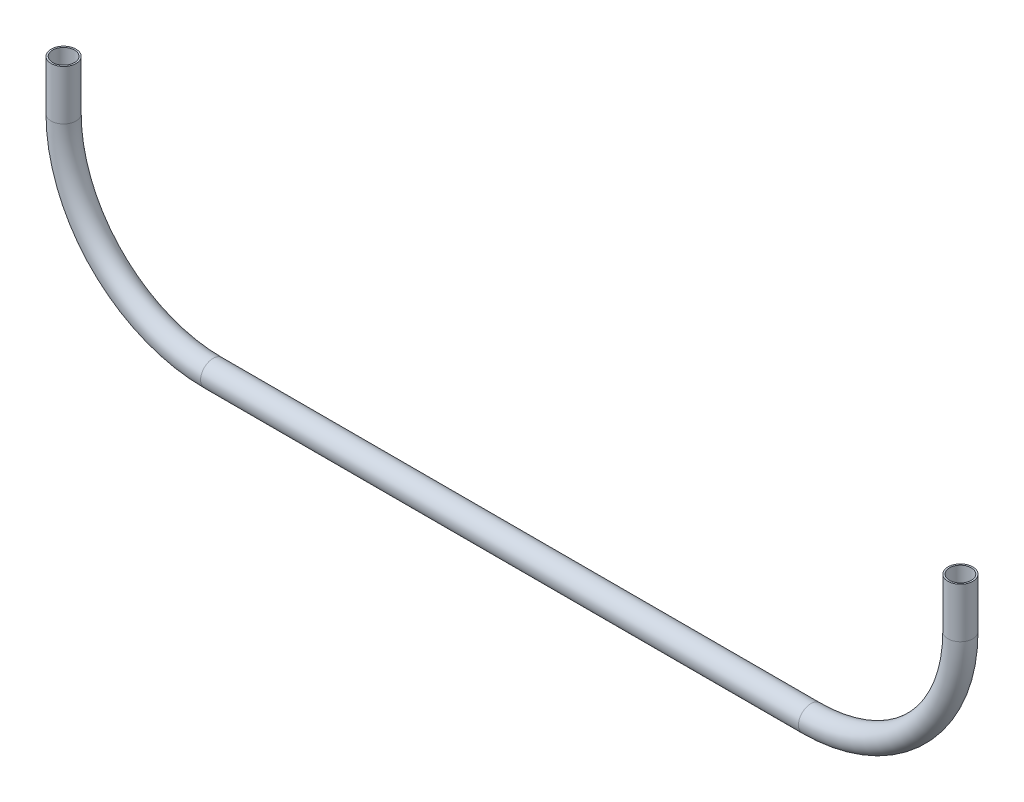
ISO-10303-21;
HEADER;
FILE_DESCRIPTION(('STEP AP214'),'2;1');
FILE_NAME('part.step','',(''),(''),'','','');
FILE_SCHEMA(('AUTOMOTIVE_DESIGN { 1 0 10303 214 1 1 1 1 }'));
ENDSEC;
DATA;
#1=APPLICATION_CONTEXT('core data for automotive mechanical design processes');
#2=APPLICATION_PROTOCOL_DEFINITION('international standard','automotive_design',2000,#1);
#3=PRODUCT_CONTEXT('',#1,'mechanical');
#4=PRODUCT('Part','Part','',(#3));
#5=PRODUCT_RELATED_PRODUCT_CATEGORY('part','',(#4));
#6=PRODUCT_DEFINITION_FORMATION('','',#4);
#7=PRODUCT_DEFINITION_CONTEXT('part definition',#1,'design');
#8=PRODUCT_DEFINITION('design','',#6,#7);
#9=PRODUCT_DEFINITION_SHAPE('','',#8);
#10=(LENGTH_UNIT() NAMED_UNIT(*) SI_UNIT(.MILLI.,.METRE.));
#11=(NAMED_UNIT(*) PLANE_ANGLE_UNIT() SI_UNIT($,.RADIAN.));
#12=(NAMED_UNIT(*) SI_UNIT($,.STERADIAN.) SOLID_ANGLE_UNIT());
#13=UNCERTAINTY_MEASURE_WITH_UNIT(LENGTH_MEASURE(1.E-05),#10,'distance_accuracy_value','');
#14=(GEOMETRIC_REPRESENTATION_CONTEXT(3) GLOBAL_UNCERTAINTY_ASSIGNED_CONTEXT((#13)) GLOBAL_UNIT_ASSIGNED_CONTEXT((#10,
#11,#12)) REPRESENTATION_CONTEXT('',''));
#15=CARTESIAN_POINT('',(0.,0.,0.));
#16=DIRECTION('',(0.,0.,1.));
#17=DIRECTION('',(1.,0.,0.));
#18=AXIS2_PLACEMENT_3D('',#15,#16,#17);
#19=CARTESIAN_POINT('',(228.6,76.2000000000006,0.));
#20=DIRECTION('',(0.,1.,0.));
#21=DIRECTION('',(0.,0.,1.));
#22=AXIS2_PLACEMENT_3D('',#19,#20,#21);
#23=CYLINDRICAL_SURFACE('',#22,6.35);
#24=CARTESIAN_POINT('',(228.6,76.2000000000006,0.));
#25=DIRECTION('',(0.,-1.,0.));
#26=DIRECTION('',(0.,0.,1.));
#27=AXIS2_PLACEMENT_3D('',#24,#25,#26);
#28=CIRCLE('',#27,6.35);
#29=CARTESIAN_POINT('',(234.95,76.2000000000007,0.));
#30=VERTEX_POINT('',#29);
#31=EDGE_CURVE('E43',#30,#30,#28,.T.);
#32=ORIENTED_EDGE('',*,*,#31,.F.);
#33=EDGE_LOOP('',(#32));
#34=FACE_BOUND('',#33,.T.);
#35=CARTESIAN_POINT('',(228.6,101.6,0.));
#36=DIRECTION('',(0.,-1.,0.));
#37=DIRECTION('',(0.,0.,1.));
#38=AXIS2_PLACEMENT_3D('',#35,#36,#37);
#39=CIRCLE('',#38,6.35);
#40=CARTESIAN_POINT('',(228.6,101.6,6.35));
#41=VERTEX_POINT('',#40);
#42=EDGE_CURVE('E10',#41,#41,#39,.T.);
#43=ORIENTED_EDGE('',*,*,#42,.T.);
#44=EDGE_LOOP('',(#43));
#45=FACE_BOUND('',#44,.T.);
#46=ADVANCED_FACE('F33',(#34,#45),#23,.T.);
#47=CARTESIAN_POINT('',(228.6,76.2000000000006,0.));
#48=DIRECTION('',(0.,1.,0.));
#49=DIRECTION('',(0.,0.,1.));
#50=AXIS2_PLACEMENT_3D('',#47,#48,#49);
#51=CYLINDRICAL_SURFACE('',#50,5.55625);
#52=CARTESIAN_POINT('',(228.6,76.2000000000006,0.));
#53=DIRECTION('',(0.,-1.,0.));
#54=DIRECTION('',(0.,0.,1.));
#55=AXIS2_PLACEMENT_3D('',#52,#53,#54);
#56=CIRCLE('',#55,5.55625);
#57=CARTESIAN_POINT('',(234.15625,76.2000000000007,0.));
#58=VERTEX_POINT('',#57);
#59=EDGE_CURVE('E47',#58,#58,#56,.T.);
#60=ORIENTED_EDGE('',*,*,#59,.T.);
#61=EDGE_LOOP('',(#60));
#62=FACE_BOUND('',#61,.T.);
#63=CARTESIAN_POINT('',(228.6,101.6,0.));
#64=DIRECTION('',(0.,-1.,0.));
#65=DIRECTION('',(0.,0.,1.));
#66=AXIS2_PLACEMENT_3D('',#63,#64,#65);
#67=CIRCLE('',#66,5.55625);
#68=CARTESIAN_POINT('',(228.6,101.6,5.55625));
#69=VERTEX_POINT('',#68);
#70=EDGE_CURVE('E39',#69,#69,#67,.T.);
#71=ORIENTED_EDGE('',*,*,#70,.F.);
#72=EDGE_LOOP('',(#71));
#73=FACE_BOUND('',#72,.T.);
#74=ADVANCED_FACE('F102',(#62,#73),#51,.F.);
#75=CARTESIAN_POINT('',(152.4,76.2000000000001,0.));
#76=DIRECTION('',(0.,0.,1.));
#77=DIRECTION('',(1.,0.,0.));
#78=AXIS2_PLACEMENT_3D('',#75,#76,#77);
#79=TOROIDAL_SURFACE('',#78,76.2,6.35);
#80=CARTESIAN_POINT('',(152.399999999999,0.,0.));
#81=DIRECTION('',(-1.,0.,0.));
#82=DIRECTION('',(0.,0.,1.));
#83=AXIS2_PLACEMENT_3D('',#80,#81,#82);
#84=CIRCLE('',#83,6.35);
#85=CARTESIAN_POINT('',(152.399999999999,-6.3499999999999,0.));
#86=VERTEX_POINT('',#85);
#87=EDGE_CURVE('E52',#86,#86,#84,.T.);
#88=CARTESIAN_POINT('',(152.4,76.2000000000001,0.));
#89=DIRECTION('',(0.,0.,1.));
#90=DIRECTION('',(1.,0.,0.));
#91=AXIS2_PLACEMENT_3D('',#88,#89,#90);
#92=CIRCLE('',#91,82.55);
#93=EDGE_CURVE('',#86,#30,#92,.T.);
#94=ORIENTED_EDGE('',*,*,#87,.F.);
#95=ORIENTED_EDGE('',*,*,#31,.T.);
#96=ORIENTED_EDGE('',*,*,#93,.T.);
#97=ORIENTED_EDGE('',*,*,#93,.F.);
#98=EDGE_LOOP('',(#94,#96,#95,#97));
#99=FACE_BOUND('',#98,.T.);
#100=ADVANCED_FACE('F107',(#99),#79,.T.);
#101=CARTESIAN_POINT('',(152.4,76.2000000000001,0.));
#102=DIRECTION('',(0.,0.,1.));
#103=DIRECTION('',(1.,0.,0.));
#104=AXIS2_PLACEMENT_3D('',#101,#102,#103);
#105=TOROIDAL_SURFACE('',#104,76.2,5.55625);
#106=CARTESIAN_POINT('',(152.399999999999,0.,0.));
#107=DIRECTION('',(-1.,0.,0.));
#108=DIRECTION('',(0.,0.,1.));
#109=AXIS2_PLACEMENT_3D('',#106,#107,#108);
#110=CIRCLE('',#109,5.55625);
#111=CARTESIAN_POINT('',(152.399999999999,-5.5562499999999,0.));
#112=VERTEX_POINT('',#111);
#113=EDGE_CURVE('E55',#112,#112,#110,.T.);
#114=CARTESIAN_POINT('',(152.4,76.2000000000001,0.));
#115=DIRECTION('',(0.,0.,1.));
#116=DIRECTION('',(1.,0.,0.));
#117=AXIS2_PLACEMENT_3D('',#114,#115,#116);
#118=CIRCLE('',#117,81.75625);
#119=EDGE_CURVE('',#112,#58,#118,.T.);
#120=ORIENTED_EDGE('',*,*,#113,.T.);
#121=ORIENTED_EDGE('',*,*,#59,.F.);
#122=ORIENTED_EDGE('',*,*,#119,.T.);
#123=ORIENTED_EDGE('',*,*,#119,.F.);
#124=EDGE_LOOP('',(#120,#122,#121,#123));
#125=FACE_BOUND('',#124,.T.);
#126=ADVANCED_FACE('F112',(#125),#105,.F.);
#127=CARTESIAN_POINT('',(-152.399999999999,0.,0.));
#128=DIRECTION('',(1.,0.,0.));
#129=DIRECTION('',(0.,1.,0.));
#130=AXIS2_PLACEMENT_3D('',#127,#128,#129);
#131=CYLINDRICAL_SURFACE('',#130,6.35);
#132=CARTESIAN_POINT('',(-152.399999999999,0.,0.));
#133=DIRECTION('',(-1.,0.,0.));
#134=DIRECTION('',(0.,0.,1.));
#135=AXIS2_PLACEMENT_3D('',#132,#133,#134);
#136=CIRCLE('',#135,6.35);
#137=CARTESIAN_POINT('',(-152.399999999999,-6.34999999999995,0.));
#138=VERTEX_POINT('',#137);
#139=EDGE_CURVE('E58',#138,#138,#136,.T.);
#140=ORIENTED_EDGE('',*,*,#139,.F.);
#141=EDGE_LOOP('',(#140));
#142=FACE_BOUND('',#141,.T.);
#143=ORIENTED_EDGE('',*,*,#87,.T.);
#144=EDGE_LOOP('',(#143));
#145=FACE_BOUND('',#144,.T.);
#146=ADVANCED_FACE('F118',(#142,#145),#131,.T.);
#147=CARTESIAN_POINT('',(-152.399999999999,0.,0.));
#148=DIRECTION('',(1.,0.,0.));
#149=DIRECTION('',(0.,1.,0.));
#150=AXIS2_PLACEMENT_3D('',#147,#148,#149);
#151=CYLINDRICAL_SURFACE('',#150,5.55625);
#152=CARTESIAN_POINT('',(-152.399999999999,0.,0.));
#153=DIRECTION('',(-1.,0.,0.));
#154=DIRECTION('',(0.,0.,1.));
#155=AXIS2_PLACEMENT_3D('',#152,#153,#154);
#156=CIRCLE('',#155,5.55625);
#157=CARTESIAN_POINT('',(-152.399999999999,-5.55624999999996,0.));
#158=VERTEX_POINT('',#157);
#159=EDGE_CURVE('E61',#158,#158,#156,.T.);
#160=ORIENTED_EDGE('',*,*,#159,.T.);
#161=EDGE_LOOP('',(#160));
#162=FACE_BOUND('',#161,.T.);
#163=ORIENTED_EDGE('',*,*,#113,.F.);
#164=EDGE_LOOP('',(#163));
#165=FACE_BOUND('',#164,.T.);
#166=ADVANCED_FACE('F125',(#162,#165),#151,.F.);
#167=CARTESIAN_POINT('',(-152.4,76.2,0.));
#168=DIRECTION('',(0.,0.,1.));
#169=DIRECTION('',(1.,0.,0.));
#170=AXIS2_PLACEMENT_3D('',#167,#168,#169);
#171=TOROIDAL_SURFACE('',#170,76.2,6.35);
#172=CARTESIAN_POINT('',(-228.6,76.2000000000006,0.));
#173=DIRECTION('',(0.,1.,0.));
#174=DIRECTION('',(0.,0.,1.));
#175=AXIS2_PLACEMENT_3D('',#172,#173,#174);
#176=CIRCLE('',#175,6.35);
#177=CARTESIAN_POINT('',(-234.95,76.2000000000006,0.));
#178=VERTEX_POINT('',#177);
#179=EDGE_CURVE('E64',#178,#178,#176,.T.);
#180=CARTESIAN_POINT('',(-152.4,76.2,0.));
#181=DIRECTION('',(0.,0.,1.));
#182=DIRECTION('',(1.,0.,0.));
#183=AXIS2_PLACEMENT_3D('',#180,#181,#182);
#184=CIRCLE('',#183,82.55);
#185=EDGE_CURVE('',#178,#138,#184,.T.);
#186=ORIENTED_EDGE('',*,*,#179,.F.);
#187=ORIENTED_EDGE('',*,*,#139,.T.);
#188=ORIENTED_EDGE('',*,*,#185,.T.);
#189=ORIENTED_EDGE('',*,*,#185,.F.);
#190=EDGE_LOOP('',(#186,#188,#187,#189));
#191=FACE_BOUND('',#190,.T.);
#192=ADVANCED_FACE('F129',(#191),#171,.T.);
#193=CARTESIAN_POINT('',(-152.4,76.2,0.));
#194=DIRECTION('',(0.,0.,1.));
#195=DIRECTION('',(1.,0.,0.));
#196=AXIS2_PLACEMENT_3D('',#193,#194,#195);
#197=TOROIDAL_SURFACE('',#196,76.2,5.55625);
#198=CARTESIAN_POINT('',(-228.6,76.2000000000006,0.));
#199=DIRECTION('',(0.,1.,0.));
#200=DIRECTION('',(0.,0.,1.));
#201=AXIS2_PLACEMENT_3D('',#198,#199,#200);
#202=CIRCLE('',#201,5.55625);
#203=CARTESIAN_POINT('',(-234.15625,76.2000000000006,0.));
#204=VERTEX_POINT('',#203);
#205=EDGE_CURVE('E68',#204,#204,#202,.T.);
#206=CARTESIAN_POINT('',(-152.4,76.2,0.));
#207=DIRECTION('',(0.,0.,1.));
#208=DIRECTION('',(1.,0.,0.));
#209=AXIS2_PLACEMENT_3D('',#206,#207,#208);
#210=CIRCLE('',#209,81.75625);
#211=EDGE_CURVE('',#204,#158,#210,.T.);
#212=ORIENTED_EDGE('',*,*,#205,.T.);
#213=ORIENTED_EDGE('',*,*,#159,.F.);
#214=ORIENTED_EDGE('',*,*,#211,.T.);
#215=ORIENTED_EDGE('',*,*,#211,.F.);
#216=EDGE_LOOP('',(#212,#214,#213,#215));
#217=FACE_BOUND('',#216,.T.);
#218=ADVANCED_FACE('F77',(#217),#197,.F.);
#219=CARTESIAN_POINT('',(-228.6,76.2000000000006,0.));
#220=DIRECTION('',(0.,1.,0.));
#221=DIRECTION('',(0.,0.,1.));
#222=AXIS2_PLACEMENT_3D('',#219,#220,#221);
#223=CYLINDRICAL_SURFACE('',#222,5.55625);
#224=ORIENTED_EDGE('',*,*,#205,.F.);
#225=EDGE_LOOP('',(#224));
#226=FACE_BOUND('',#225,.T.);
#227=CARTESIAN_POINT('',(-228.6,101.6,0.));
#228=DIRECTION('',(0.,1.,0.));
#229=DIRECTION('',(0.,0.,1.));
#230=AXIS2_PLACEMENT_3D('',#227,#228,#229);
#231=CIRCLE('',#230,5.55625);
#232=CARTESIAN_POINT('',(-228.6,101.6,5.55625));
#233=VERTEX_POINT('',#232);
#234=EDGE_CURVE('E69',#233,#233,#231,.T.);
#235=ORIENTED_EDGE('',*,*,#234,.T.);
#236=EDGE_LOOP('',(#235));
#237=FACE_BOUND('',#236,.T.);
#238=ADVANCED_FACE('F80',(#226,#237),#223,.F.);
#239=CARTESIAN_POINT('',(-228.6,76.2000000000006,0.));
#240=DIRECTION('',(0.,1.,0.));
#241=DIRECTION('',(0.,0.,1.));
#242=AXIS2_PLACEMENT_3D('',#239,#240,#241);
#243=CYLINDRICAL_SURFACE('',#242,6.35);
#244=ORIENTED_EDGE('',*,*,#179,.T.);
#245=EDGE_LOOP('',(#244));
#246=FACE_BOUND('',#245,.T.);
#247=CARTESIAN_POINT('',(-228.6,101.6,0.));
#248=DIRECTION('',(0.,1.,0.));
#249=DIRECTION('',(0.,0.,1.));
#250=AXIS2_PLACEMENT_3D('',#247,#248,#249);
#251=CIRCLE('',#250,6.35);
#252=CARTESIAN_POINT('',(-228.6,101.6,6.35));
#253=VERTEX_POINT('',#252);
#254=EDGE_CURVE('E65',#253,#253,#251,.T.);
#255=ORIENTED_EDGE('',*,*,#254,.F.);
#256=EDGE_LOOP('',(#255));
#257=FACE_BOUND('',#256,.T.);
#258=ADVANCED_FACE('F83',(#246,#257),#243,.T.);
#259=CARTESIAN_POINT('',(228.6,101.6,0.));
#260=DIRECTION('',(0.,-1.,0.));
#261=DIRECTION('',(0.,0.,1.));
#262=AXIS2_PLACEMENT_3D('',#259,#260,#261);
#263=PLANE('',#262);
#264=ORIENTED_EDGE('',*,*,#70,.T.);
#265=EDGE_LOOP('',(#264));
#266=FACE_BOUND('',#265,.T.);
#267=ORIENTED_EDGE('',*,*,#42,.F.);
#268=EDGE_LOOP('',(#267));
#269=FACE_BOUND('',#268,.T.);
#270=ADVANCED_FACE('F90',(#266,#269),#263,.F.);
#271=CARTESIAN_POINT('',(-228.6,101.6,0.));
#272=DIRECTION('',(0.,1.,0.));
#273=DIRECTION('',(0.,0.,1.));
#274=AXIS2_PLACEMENT_3D('',#271,#272,#273);
#275=PLANE('',#274);
#276=ORIENTED_EDGE('',*,*,#234,.F.);
#277=EDGE_LOOP('',(#276));
#278=FACE_BOUND('',#277,.T.);
#279=ORIENTED_EDGE('',*,*,#254,.T.);
#280=EDGE_LOOP('',(#279));
#281=FACE_BOUND('',#280,.T.);
#282=ADVANCED_FACE('F87',(#278,#281),#275,.T.);
#283=CLOSED_SHELL('',(#46,#74,#100,#126,#146,#166,#192,#218,#238,#258,#270,#282));
#284=MANIFOLD_SOLID_BREP('B2',#283);
#285=ADVANCED_BREP_SHAPE_REPRESENTATION('',(#18,#284),#14);
#286=SHAPE_DEFINITION_REPRESENTATION(#9,#285);
ENDSEC;
END-ISO-10303-21;
